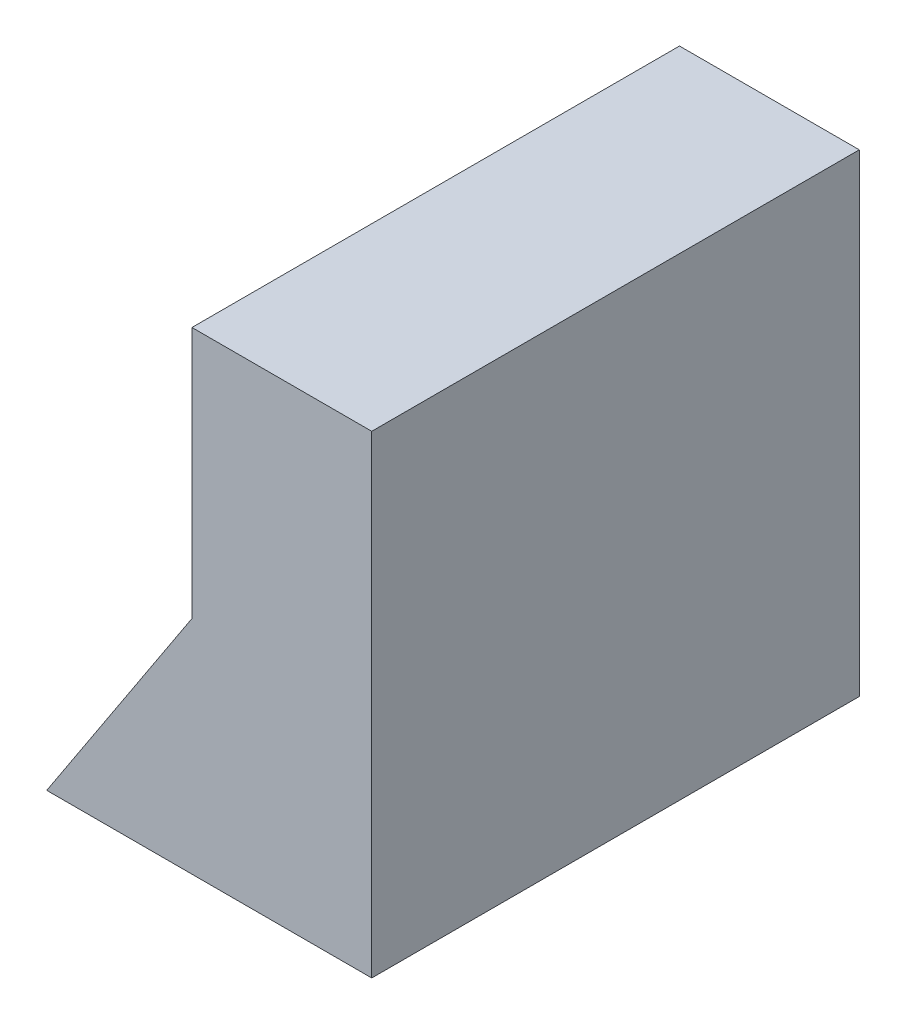
ISO-10303-21;
HEADER;
FILE_DESCRIPTION(('STEP AP214'),'2;1');
FILE_NAME('part.step','',(''),(''),'','','');
FILE_SCHEMA(('AUTOMOTIVE_DESIGN { 1 0 10303 214 1 1 1 1 }'));
ENDSEC;
DATA;
#1=APPLICATION_CONTEXT('core data for automotive mechanical design processes');
#2=APPLICATION_PROTOCOL_DEFINITION('international standard','automotive_design',2000,#1);
#3=PRODUCT_CONTEXT('',#1,'mechanical');
#4=PRODUCT('Part','Part','',(#3));
#5=PRODUCT_RELATED_PRODUCT_CATEGORY('part','',(#4));
#6=PRODUCT_DEFINITION_FORMATION('','',#4);
#7=PRODUCT_DEFINITION_CONTEXT('part definition',#1,'design');
#8=PRODUCT_DEFINITION('design','',#6,#7);
#9=PRODUCT_DEFINITION_SHAPE('','',#8);
#10=(LENGTH_UNIT() NAMED_UNIT(*) SI_UNIT(.MILLI.,.METRE.));
#11=(NAMED_UNIT(*) PLANE_ANGLE_UNIT() SI_UNIT($,.RADIAN.));
#12=(NAMED_UNIT(*) SI_UNIT($,.STERADIAN.) SOLID_ANGLE_UNIT());
#13=UNCERTAINTY_MEASURE_WITH_UNIT(LENGTH_MEASURE(1.E-05),#10,'distance_accuracy_value','');
#14=(GEOMETRIC_REPRESENTATION_CONTEXT(3) GLOBAL_UNCERTAINTY_ASSIGNED_CONTEXT((#13)) GLOBAL_UNIT_ASSIGNED_CONTEXT((#10,
#11,#12)) REPRESENTATION_CONTEXT('',''));
#15=CARTESIAN_POINT('',(0.,0.,0.));
#16=DIRECTION('',(0.,0.,1.));
#17=DIRECTION('',(1.,0.,0.));
#18=AXIS2_PLACEMENT_3D('',#15,#16,#17);
#19=CARTESIAN_POINT('',(24.3279511822091,28.4788870518256,9.));
#20=DIRECTION('',(-1.,0.,0.));
#21=DIRECTION('',(0.,0.,1.));
#22=AXIS2_PLACEMENT_3D('',#19,#20,#21);
#23=PLANE('',#22);
#24=DIRECTION('',(0.,1.,0.));
#25=VECTOR('',#24,1.);
#26=CARTESIAN_POINT('',(24.3279511822091,28.4788870518256,-9.));
#27=LINE('',#26,#25);
#28=CARTESIAN_POINT('',(24.3279511822091,28.4788870518256,-9.));
#29=VERTEX_POINT('',#28);
#30=CARTESIAN_POINT('',(24.3279511822091,37.7855018501899,-9.));
#31=VERTEX_POINT('',#30);
#32=EDGE_CURVE('E119',#29,#31,#27,.T.);
#33=ORIENTED_EDGE('',*,*,#32,.F.);
#34=DIRECTION('',(0.,0.,-1.));
#35=VECTOR('',#34,1.);
#36=CARTESIAN_POINT('',(24.3279511822091,28.4788870518256,9.));
#37=LINE('',#36,#35);
#38=CARTESIAN_POINT('',(24.3279511822091,28.4788870518256,9.));
#39=VERTEX_POINT('',#38);
#40=EDGE_CURVE('E11',#39,#29,#37,.T.);
#41=ORIENTED_EDGE('',*,*,#40,.F.);
#42=DIRECTION('',(0.,1.,0.));
#43=VECTOR('',#42,1.);
#44=CARTESIAN_POINT('',(24.3279511822091,28.4788870518256,9.));
#45=LINE('',#44,#43);
#46=CARTESIAN_POINT('',(24.3279511822091,37.7855018501899,9.));
#47=VERTEX_POINT('',#46);
#48=EDGE_CURVE('E135',#39,#47,#45,.T.);
#49=ORIENTED_EDGE('',*,*,#48,.T.);
#50=DIRECTION('',(0.,0.,-1.));
#51=VECTOR('',#50,1.);
#52=CARTESIAN_POINT('',(24.3279511822091,37.7855018501899,9.));
#53=LINE('',#52,#51);
#54=EDGE_CURVE('E42',#47,#31,#53,.T.);
#55=ORIENTED_EDGE('',*,*,#54,.T.);
#56=EDGE_LOOP('',(#33,#41,#49,#55));
#57=FACE_BOUND('',#56,.T.);
#58=ADVANCED_FACE('F39',(#57),#23,.T.);
#59=CARTESIAN_POINT('',(18.9660677701221,20.3044120298741,9.));
#60=DIRECTION('',(-0.836170626695574,0.548469400287319,0.));
#61=DIRECTION('',(-0.548469400287319,-0.836170626695574,0.));
#62=AXIS2_PLACEMENT_3D('',#59,#60,#61);
#63=PLANE('',#62);
#64=DIRECTION('',(0.548469400287319,0.836170626695574,0.));
#65=VECTOR('',#64,1.);
#66=CARTESIAN_POINT('',(18.9660677701221,20.3044120298741,-9.));
#67=LINE('',#66,#65);
#68=CARTESIAN_POINT('',(18.9660677701221,20.3044120298741,-9.));
#69=VERTEX_POINT('',#68);
#70=EDGE_CURVE('E132',#69,#29,#67,.T.);
#71=ORIENTED_EDGE('',*,*,#70,.F.);
#72=DIRECTION('',(0.,0.,-1.));
#73=VECTOR('',#72,1.);
#74=CARTESIAN_POINT('',(18.9660677701221,20.3044120298741,9.));
#75=LINE('',#74,#73);
#76=CARTESIAN_POINT('',(18.9660677701221,20.3044120298741,9.));
#77=VERTEX_POINT('',#76);
#78=EDGE_CURVE('E49',#77,#69,#75,.T.);
#79=ORIENTED_EDGE('',*,*,#78,.F.);
#80=DIRECTION('',(0.548469400287319,0.836170626695574,0.));
#81=VECTOR('',#80,1.);
#82=CARTESIAN_POINT('',(18.9660677701221,20.3044120298741,9.));
#83=LINE('',#82,#81);
#84=EDGE_CURVE('E112',#77,#39,#83,.T.);
#85=ORIENTED_EDGE('',*,*,#84,.T.);
#86=ORIENTED_EDGE('',*,*,#40,.T.);
#87=EDGE_LOOP('',(#71,#79,#85,#86));
#88=FACE_BOUND('',#87,.T.);
#89=ADVANCED_FACE('F143',(#88),#63,.T.);
#90=CARTESIAN_POINT('',(30.9660677701221,20.3044120298741,9.));
#91=DIRECTION('',(0.,-1.,0.));
#92=DIRECTION('',(0.,0.,-1.));
#93=AXIS2_PLACEMENT_3D('',#90,#91,#92);
#94=PLANE('',#93);
#95=DIRECTION('',(-1.,0.,0.));
#96=VECTOR('',#95,1.);
#97=CARTESIAN_POINT('',(30.9660677701221,20.3044120298741,-9.));
#98=LINE('',#97,#96);
#99=CARTESIAN_POINT('',(30.9660677701221,20.3044120298741,-9.));
#100=VERTEX_POINT('',#99);
#101=EDGE_CURVE('E107',#100,#69,#98,.T.);
#102=ORIENTED_EDGE('',*,*,#101,.F.);
#103=DIRECTION('',(0.,0.,-1.));
#104=VECTOR('',#103,1.);
#105=CARTESIAN_POINT('',(30.9660677701221,20.3044120298741,9.));
#106=LINE('',#105,#104);
#107=CARTESIAN_POINT('',(30.9660677701221,20.3044120298741,9.));
#108=VERTEX_POINT('',#107);
#109=EDGE_CURVE('E96',#108,#100,#106,.T.);
#110=ORIENTED_EDGE('',*,*,#109,.F.);
#111=DIRECTION('',(-1.,0.,0.));
#112=VECTOR('',#111,1.);
#113=CARTESIAN_POINT('',(30.9660677701221,20.3044120298741,9.));
#114=LINE('',#113,#112);
#115=EDGE_CURVE('E102',#108,#77,#114,.T.);
#116=ORIENTED_EDGE('',*,*,#115,.T.);
#117=ORIENTED_EDGE('',*,*,#78,.T.);
#118=EDGE_LOOP('',(#102,#110,#116,#117));
#119=FACE_BOUND('',#118,.T.);
#120=ADVANCED_FACE('F105',(#119),#94,.T.);
#121=CARTESIAN_POINT('',(30.9660677701221,28.4788870518256,9.));
#122=DIRECTION('',(1.,0.,0.));
#123=DIRECTION('',(0.,0.,-1.));
#124=AXIS2_PLACEMENT_3D('',#121,#122,#123);
#125=PLANE('',#124);
#126=DIRECTION('',(0.,-1.,0.));
#127=VECTOR('',#126,1.);
#128=CARTESIAN_POINT('',(30.9660677701221,28.4788870518256,-9.));
#129=LINE('',#128,#127);
#130=CARTESIAN_POINT('',(30.9660677701221,37.7855018501899,-9.));
#131=VERTEX_POINT('',#130);
#132=EDGE_CURVE('E127',#131,#100,#129,.T.);
#133=ORIENTED_EDGE('',*,*,#132,.F.);
#134=DIRECTION('',(0.,0.,-1.));
#135=VECTOR('',#134,1.);
#136=CARTESIAN_POINT('',(30.9660677701221,37.7855018501899,9.));
#137=LINE('',#136,#135);
#138=CARTESIAN_POINT('',(30.9660677701221,37.7855018501899,9.));
#139=VERTEX_POINT('',#138);
#140=EDGE_CURVE('E98',#139,#131,#137,.T.);
#141=ORIENTED_EDGE('',*,*,#140,.F.);
#142=DIRECTION('',(0.,-1.,0.));
#143=VECTOR('',#142,1.);
#144=CARTESIAN_POINT('',(30.9660677701221,37.7855018501899,9.));
#145=LINE('',#144,#143);
#146=EDGE_CURVE('E93',#139,#108,#145,.T.);
#147=ORIENTED_EDGE('',*,*,#146,.T.);
#148=ORIENTED_EDGE('',*,*,#109,.T.);
#149=EDGE_LOOP('',(#133,#141,#147,#148));
#150=FACE_BOUND('',#149,.T.);
#151=ADVANCED_FACE('F95',(#150),#125,.T.);
#152=CARTESIAN_POINT('',(24.3279511822091,37.7855018501899,9.));
#153=DIRECTION('',(0.,1.,0.));
#154=DIRECTION('',(0.,0.,1.));
#155=AXIS2_PLACEMENT_3D('',#152,#153,#154);
#156=PLANE('',#155);
#157=DIRECTION('',(1.,0.,0.));
#158=VECTOR('',#157,1.);
#159=CARTESIAN_POINT('',(24.3279511822091,37.7855018501899,-9.));
#160=LINE('',#159,#158);
#161=EDGE_CURVE('E123',#31,#131,#160,.T.);
#162=ORIENTED_EDGE('',*,*,#161,.F.);
#163=ORIENTED_EDGE('',*,*,#54,.F.);
#164=DIRECTION('',(1.,0.,0.));
#165=VECTOR('',#164,1.);
#166=CARTESIAN_POINT('',(24.3279511822091,37.7855018501899,9.));
#167=LINE('',#166,#165);
#168=EDGE_CURVE('E103',#47,#139,#167,.T.);
#169=ORIENTED_EDGE('',*,*,#168,.T.);
#170=ORIENTED_EDGE('',*,*,#140,.T.);
#171=EDGE_LOOP('',(#162,#163,#169,#170));
#172=FACE_BOUND('',#171,.T.);
#173=ADVANCED_FACE('F140',(#172),#156,.T.);
#174=CARTESIAN_POINT('',(0.,0.,9.));
#175=DIRECTION('',(0.,0.,-1.));
#176=DIRECTION('',(-1.,0.,0.));
#177=AXIS2_PLACEMENT_3D('',#174,#175,#176);
#178=PLANE('',#177);
#179=ORIENTED_EDGE('',*,*,#48,.F.);
#180=ORIENTED_EDGE('',*,*,#84,.F.);
#181=ORIENTED_EDGE('',*,*,#115,.F.);
#182=ORIENTED_EDGE('',*,*,#146,.F.);
#183=ORIENTED_EDGE('',*,*,#168,.F.);
#184=EDGE_LOOP('',(#179,#180,#181,#182,#183));
#185=FACE_BOUND('',#184,.T.);
#186=ADVANCED_FACE('F111',(#185),#178,.F.);
#187=CARTESIAN_POINT('',(0.,0.,-9.));
#188=DIRECTION('',(0.,0.,-1.));
#189=DIRECTION('',(-1.,0.,0.));
#190=AXIS2_PLACEMENT_3D('',#187,#188,#189);
#191=PLANE('',#190);
#192=ORIENTED_EDGE('',*,*,#32,.T.);
#193=ORIENTED_EDGE('',*,*,#161,.T.);
#194=ORIENTED_EDGE('',*,*,#132,.T.);
#195=ORIENTED_EDGE('',*,*,#101,.T.);
#196=ORIENTED_EDGE('',*,*,#70,.T.);
#197=EDGE_LOOP('',(#192,#193,#194,#195,#196));
#198=FACE_BOUND('',#197,.T.);
#199=ADVANCED_FACE('F142',(#198),#191,.T.);
#200=CLOSED_SHELL('',(#58,#89,#120,#151,#173,#186,#199));
#201=MANIFOLD_SOLID_BREP('B2',#200);
#202=ADVANCED_BREP_SHAPE_REPRESENTATION('',(#18,#201),#14);
#203=SHAPE_DEFINITION_REPRESENTATION(#9,#202);
ENDSEC;
END-ISO-10303-21;
